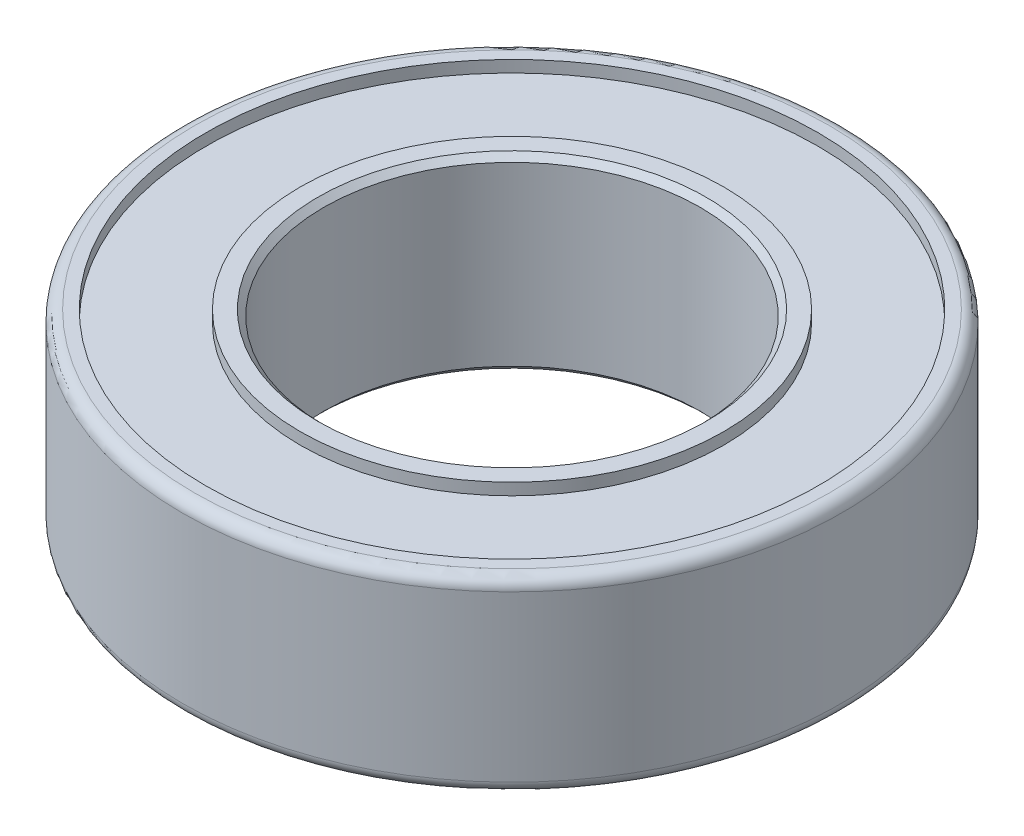
ISO-10303-21;
HEADER;
FILE_DESCRIPTION(('STEP AP214'),'2;1');
FILE_NAME('part.step','',(''),(''),'','','');
FILE_SCHEMA(('AUTOMOTIVE_DESIGN { 1 0 10303 214 1 1 1 1 }'));
ENDSEC;
DATA;
#1=APPLICATION_CONTEXT('core data for automotive mechanical design processes');
#2=APPLICATION_PROTOCOL_DEFINITION('international standard','automotive_design',2000,#1);
#3=PRODUCT_CONTEXT('',#1,'mechanical');
#4=PRODUCT('Part','Part','',(#3));
#5=PRODUCT_RELATED_PRODUCT_CATEGORY('part','',(#4));
#6=PRODUCT_DEFINITION_FORMATION('','',#4);
#7=PRODUCT_DEFINITION_CONTEXT('part definition',#1,'design');
#8=PRODUCT_DEFINITION('design','',#6,#7);
#9=PRODUCT_DEFINITION_SHAPE('','',#8);
#10=(LENGTH_UNIT() NAMED_UNIT(*) SI_UNIT(.MILLI.,.METRE.));
#11=(NAMED_UNIT(*) PLANE_ANGLE_UNIT() SI_UNIT($,.RADIAN.));
#12=(NAMED_UNIT(*) SI_UNIT($,.STERADIAN.) SOLID_ANGLE_UNIT());
#13=UNCERTAINTY_MEASURE_WITH_UNIT(LENGTH_MEASURE(1.E-05),#10,'distance_accuracy_value','');
#14=(GEOMETRIC_REPRESENTATION_CONTEXT(3) GLOBAL_UNCERTAINTY_ASSIGNED_CONTEXT((#13)) GLOBAL_UNIT_ASSIGNED_CONTEXT((#10,
#11,#12)) REPRESENTATION_CONTEXT('',''));
#15=CARTESIAN_POINT('',(0.,0.,0.));
#16=DIRECTION('',(0.,0.,1.));
#17=DIRECTION('',(1.,0.,0.));
#18=AXIS2_PLACEMENT_3D('',#15,#16,#17);
#19=CARTESIAN_POINT('',(0.,-2.,0.));
#20=DIRECTION('',(0.,1.,0.));
#21=DIRECTION('',(0.,0.,1.));
#22=AXIS2_PLACEMENT_3D('',#19,#20,#21);
#23=PLANE('',#22);
#24=CARTESIAN_POINT('',(0.,-2.,0.));
#25=DIRECTION('',(0.,1.,0.));
#26=DIRECTION('',(0.,0.,1.));
#27=AXIS2_PLACEMENT_3D('',#24,#25,#26);
#28=CIRCLE('',#27,4.125);
#29=CARTESIAN_POINT('',(0.,-2.,4.125));
#30=VERTEX_POINT('',#29);
#31=EDGE_CURVE('E10',#30,#30,#28,.T.);
#32=ORIENTED_EDGE('',*,*,#31,.T.);
#33=EDGE_LOOP('',(#32));
#34=FACE_BOUND('',#33,.T.);
#35=CARTESIAN_POINT('',(0.,-2.,0.));
#36=DIRECTION('',(0.,1.,0.));
#37=DIRECTION('',(0.,0.,1.));
#38=AXIS2_PLACEMENT_3D('',#35,#36,#37);
#39=CIRCLE('',#38,4.5);
#40=CARTESIAN_POINT('',(0.,-2.,4.5));
#41=VERTEX_POINT('',#40);
#42=EDGE_CURVE('E97',#41,#41,#39,.T.);
#43=ORIENTED_EDGE('',*,*,#42,.F.);
#44=EDGE_LOOP('',(#43));
#45=FACE_BOUND('',#44,.T.);
#46=ADVANCED_FACE('F45',(#34,#45),#23,.F.);
#47=CARTESIAN_POINT('',(0.,2.,0.));
#48=DIRECTION('',(0.,1.,0.));
#49=DIRECTION('',(0.,0.,1.));
#50=AXIS2_PLACEMENT_3D('',#47,#48,#49);
#51=PLANE('',#50);
#52=CARTESIAN_POINT('',(0.,2.,0.));
#53=DIRECTION('',(0.,1.,0.));
#54=DIRECTION('',(0.,0.,1.));
#55=AXIS2_PLACEMENT_3D('',#52,#53,#54);
#56=CIRCLE('',#55,4.125);
#57=CARTESIAN_POINT('',(0.,2.,4.125));
#58=VERTEX_POINT('',#57);
#59=EDGE_CURVE('E53',#58,#58,#56,.F.);
#60=ORIENTED_EDGE('',*,*,#59,.T.);
#61=EDGE_LOOP('',(#60));
#62=FACE_BOUND('',#61,.T.);
#63=CARTESIAN_POINT('',(0.,2.,0.));
#64=DIRECTION('',(0.,1.,0.));
#65=DIRECTION('',(0.,0.,1.));
#66=AXIS2_PLACEMENT_3D('',#63,#64,#65);
#67=CIRCLE('',#66,4.5);
#68=CARTESIAN_POINT('',(0.,2.,4.5));
#69=VERTEX_POINT('',#68);
#70=EDGE_CURVE('E85',#69,#69,#67,.T.);
#71=ORIENTED_EDGE('',*,*,#70,.T.);
#72=EDGE_LOOP('',(#71));
#73=FACE_BOUND('',#72,.T.);
#74=ADVANCED_FACE('F114',(#62,#73),#51,.T.);
#75=CARTESIAN_POINT('',(0.,2.,0.));
#76=DIRECTION('',(0.,1.,0.));
#77=DIRECTION('',(0.,0.,1.));
#78=AXIS2_PLACEMENT_3D('',#75,#76,#77);
#79=CIRCLE('',#78,6.75);
#80=CARTESIAN_POINT('',(0.,2.,6.75));
#81=VERTEX_POINT('',#80);
#82=EDGE_CURVE('E66',#81,#81,#79,.T.);
#83=ORIENTED_EDGE('',*,*,#82,.T.);
#84=EDGE_LOOP('',(#83));
#85=FACE_BOUND('',#84,.T.);
#86=CARTESIAN_POINT('',(0.,2.,0.));
#87=DIRECTION('',(0.,1.,0.));
#88=DIRECTION('',(0.,0.,1.));
#89=AXIS2_PLACEMENT_3D('',#86,#87,#88);
#90=CIRCLE('',#89,6.5);
#91=CARTESIAN_POINT('',(0.,2.,6.5));
#92=VERTEX_POINT('',#91);
#93=EDGE_CURVE('E79',#92,#92,#90,.T.);
#94=ORIENTED_EDGE('',*,*,#93,.F.);
#95=EDGE_LOOP('',(#94));
#96=FACE_BOUND('',#95,.T.);
#97=ADVANCED_FACE('F121',(#85,#96),#51,.T.);
#98=CARTESIAN_POINT('',(0.,-2.,0.));
#99=DIRECTION('',(0.,1.,0.));
#100=DIRECTION('',(0.,0.,1.));
#101=AXIS2_PLACEMENT_3D('',#98,#99,#100);
#102=CIRCLE('',#101,6.75);
#103=CARTESIAN_POINT('',(0.,-2.,6.75));
#104=VERTEX_POINT('',#103);
#105=EDGE_CURVE('E69',#104,#104,#102,.F.);
#106=ORIENTED_EDGE('',*,*,#105,.T.);
#107=EDGE_LOOP('',(#106));
#108=FACE_BOUND('',#107,.T.);
#109=CARTESIAN_POINT('',(0.,-2.,0.));
#110=DIRECTION('',(0.,1.,0.));
#111=DIRECTION('',(0.,0.,1.));
#112=AXIS2_PLACEMENT_3D('',#109,#110,#111);
#113=CIRCLE('',#112,6.5);
#114=CARTESIAN_POINT('',(0.,-2.,6.5));
#115=VERTEX_POINT('',#114);
#116=EDGE_CURVE('E91',#115,#115,#113,.T.);
#117=ORIENTED_EDGE('',*,*,#116,.T.);
#118=EDGE_LOOP('',(#117));
#119=FACE_BOUND('',#118,.T.);
#120=ADVANCED_FACE('F116',(#108,#119),#23,.F.);
#121=CARTESIAN_POINT('',(0.,2.,0.));
#122=DIRECTION('',(0.,-1.,0.));
#123=DIRECTION('',(0.,0.,-1.));
#124=AXIS2_PLACEMENT_3D('',#121,#122,#123);
#125=CYLINDRICAL_SURFACE('',#124,7.);
#126=CARTESIAN_POINT('',(0.,-1.75,0.));
#127=DIRECTION('',(0.,1.,0.));
#128=DIRECTION('',(0.,0.,1.));
#129=AXIS2_PLACEMENT_3D('',#126,#127,#128);
#130=CIRCLE('',#129,7.);
#131=CARTESIAN_POINT('',(0.,-1.75,7.));
#132=VERTEX_POINT('',#131);
#133=EDGE_CURVE('E72',#132,#132,#130,.T.);
#134=ORIENTED_EDGE('',*,*,#133,.T.);
#135=EDGE_LOOP('',(#134));
#136=FACE_BOUND('',#135,.T.);
#137=CARTESIAN_POINT('',(0.,1.75,0.));
#138=DIRECTION('',(0.,1.,0.));
#139=DIRECTION('',(0.,0.,1.));
#140=AXIS2_PLACEMENT_3D('',#137,#138,#139);
#141=CIRCLE('',#140,7.);
#142=CARTESIAN_POINT('',(0.,1.75,7.));
#143=VERTEX_POINT('',#142);
#144=EDGE_CURVE('E75',#143,#143,#141,.F.);
#145=ORIENTED_EDGE('',*,*,#144,.T.);
#146=EDGE_LOOP('',(#145));
#147=FACE_BOUND('',#146,.T.);
#148=ADVANCED_FACE('F125',(#136,#147),#125,.T.);
#149=CARTESIAN_POINT('',(0.,2.,0.));
#150=DIRECTION('',(0.,-1.,0.));
#151=DIRECTION('',(0.,0.,-1.));
#152=AXIS2_PLACEMENT_3D('',#149,#150,#151);
#153=CYLINDRICAL_SURFACE('',#152,4.);
#154=CARTESIAN_POINT('',(0.,1.875,0.));
#155=DIRECTION('',(0.,1.,0.));
#156=DIRECTION('',(0.,0.,1.));
#157=AXIS2_PLACEMENT_3D('',#154,#155,#156);
#158=CIRCLE('',#157,4.);
#159=CARTESIAN_POINT('',(0.,1.875,4.));
#160=VERTEX_POINT('',#159);
#161=EDGE_CURVE('E57',#160,#160,#158,.T.);
#162=ORIENTED_EDGE('',*,*,#161,.T.);
#163=EDGE_LOOP('',(#162));
#164=FACE_BOUND('',#163,.T.);
#165=CARTESIAN_POINT('',(0.,-1.875,0.));
#166=DIRECTION('',(0.,1.,0.));
#167=DIRECTION('',(0.,0.,1.));
#168=AXIS2_PLACEMENT_3D('',#165,#166,#167);
#169=CIRCLE('',#168,4.);
#170=CARTESIAN_POINT('',(0.,-1.875,4.));
#171=VERTEX_POINT('',#170);
#172=EDGE_CURVE('E61',#171,#171,#169,.F.);
#173=ORIENTED_EDGE('',*,*,#172,.T.);
#174=EDGE_LOOP('',(#173));
#175=FACE_BOUND('',#174,.T.);
#176=ADVANCED_FACE('F131',(#164,#175),#153,.F.);
#177=CARTESIAN_POINT('',(0.,1.75,0.));
#178=DIRECTION('',(0.,1.,0.));
#179=DIRECTION('',(0.,0.,1.));
#180=AXIS2_PLACEMENT_3D('',#177,#178,#179);
#181=CYLINDRICAL_SURFACE('',#180,6.5);
#182=CARTESIAN_POINT('',(0.,1.75,0.));
#183=DIRECTION('',(0.,1.,0.));
#184=DIRECTION('',(0.,0.,1.));
#185=AXIS2_PLACEMENT_3D('',#182,#183,#184);
#186=CIRCLE('',#185,6.5);
#187=CARTESIAN_POINT('',(0.,1.75,6.5));
#188=VERTEX_POINT('',#187);
#189=EDGE_CURVE('E78',#188,#188,#186,.T.);
#190=ORIENTED_EDGE('',*,*,#189,.F.);
#191=EDGE_LOOP('',(#190));
#192=FACE_BOUND('',#191,.T.);
#193=ORIENTED_EDGE('',*,*,#93,.T.);
#194=EDGE_LOOP('',(#193));
#195=FACE_BOUND('',#194,.T.);
#196=ADVANCED_FACE('F154',(#192,#195),#181,.F.);
#197=CARTESIAN_POINT('',(0.,1.75,0.));
#198=DIRECTION('',(0.,1.,0.));
#199=DIRECTION('',(0.,0.,1.));
#200=AXIS2_PLACEMENT_3D('',#197,#198,#199);
#201=PLANE('',#200);
#202=CARTESIAN_POINT('',(0.,1.75,0.));
#203=DIRECTION('',(0.,1.,0.));
#204=DIRECTION('',(0.,0.,1.));
#205=AXIS2_PLACEMENT_3D('',#202,#203,#204);
#206=CIRCLE('',#205,4.5);
#207=CARTESIAN_POINT('',(0.,1.75,4.5));
#208=VERTEX_POINT('',#207);
#209=EDGE_CURVE('E82',#208,#208,#206,.T.);
#210=ORIENTED_EDGE('',*,*,#209,.F.);
#211=EDGE_LOOP('',(#210));
#212=FACE_BOUND('',#211,.T.);
#213=ORIENTED_EDGE('',*,*,#189,.T.);
#214=EDGE_LOOP('',(#213));
#215=FACE_BOUND('',#214,.T.);
#216=ADVANCED_FACE('F150',(#212,#215),#201,.T.);
#217=CARTESIAN_POINT('',(0.,1.75,0.));
#218=DIRECTION('',(0.,1.,0.));
#219=DIRECTION('',(0.,0.,1.));
#220=AXIS2_PLACEMENT_3D('',#217,#218,#219);
#221=CYLINDRICAL_SURFACE('',#220,4.5);
#222=ORIENTED_EDGE('',*,*,#209,.T.);
#223=EDGE_LOOP('',(#222));
#224=FACE_BOUND('',#223,.T.);
#225=ORIENTED_EDGE('',*,*,#70,.F.);
#226=EDGE_LOOP('',(#225));
#227=FACE_BOUND('',#226,.T.);
#228=ADVANCED_FACE('F144',(#224,#227),#221,.T.);
#229=CARTESIAN_POINT('',(0.,-1.75,0.));
#230=DIRECTION('',(0.,-1.,0.));
#231=DIRECTION('',(0.,0.,1.));
#232=AXIS2_PLACEMENT_3D('',#229,#230,#231);
#233=PLANE('',#232);
#234=CARTESIAN_POINT('',(0.,-1.75,0.));
#235=DIRECTION('',(0.,1.,0.));
#236=DIRECTION('',(0.,0.,1.));
#237=AXIS2_PLACEMENT_3D('',#234,#235,#236);
#238=CIRCLE('',#237,6.5);
#239=CARTESIAN_POINT('',(0.,-1.75,6.5));
#240=VERTEX_POINT('',#239);
#241=EDGE_CURVE('E88',#240,#240,#238,.T.);
#242=ORIENTED_EDGE('',*,*,#241,.F.);
#243=EDGE_LOOP('',(#242));
#244=FACE_BOUND('',#243,.T.);
#245=CARTESIAN_POINT('',(0.,-1.75,0.));
#246=DIRECTION('',(0.,1.,0.));
#247=DIRECTION('',(0.,0.,1.));
#248=AXIS2_PLACEMENT_3D('',#245,#246,#247);
#249=CIRCLE('',#248,4.5);
#250=CARTESIAN_POINT('',(0.,-1.75,4.5));
#251=VERTEX_POINT('',#250);
#252=EDGE_CURVE('E94',#251,#251,#249,.T.);
#253=ORIENTED_EDGE('',*,*,#252,.T.);
#254=EDGE_LOOP('',(#253));
#255=FACE_BOUND('',#254,.T.);
#256=ADVANCED_FACE('F103',(#244,#255),#233,.T.);
#257=CARTESIAN_POINT('',(0.,-1.75,0.));
#258=DIRECTION('',(0.,-1.,0.));
#259=DIRECTION('',(0.,0.,-1.));
#260=AXIS2_PLACEMENT_3D('',#257,#258,#259);
#261=CYLINDRICAL_SURFACE('',#260,6.5);
#262=ORIENTED_EDGE('',*,*,#241,.T.);
#263=EDGE_LOOP('',(#262));
#264=FACE_BOUND('',#263,.T.);
#265=ORIENTED_EDGE('',*,*,#116,.F.);
#266=EDGE_LOOP('',(#265));
#267=FACE_BOUND('',#266,.T.);
#268=ADVANCED_FACE('F109',(#264,#267),#261,.F.);
#269=CARTESIAN_POINT('',(0.,-1.75,0.));
#270=DIRECTION('',(0.,-1.,0.));
#271=DIRECTION('',(0.,0.,-1.));
#272=AXIS2_PLACEMENT_3D('',#269,#270,#271);
#273=CYLINDRICAL_SURFACE('',#272,4.5);
#274=ORIENTED_EDGE('',*,*,#252,.F.);
#275=EDGE_LOOP('',(#274));
#276=FACE_BOUND('',#275,.T.);
#277=ORIENTED_EDGE('',*,*,#42,.T.);
#278=EDGE_LOOP('',(#277));
#279=FACE_BOUND('',#278,.T.);
#280=ADVANCED_FACE('F105',(#276,#279),#273,.T.);
#281=CARTESIAN_POINT('',(0.,-1.75,0.));
#282=DIRECTION('',(0.,1.,0.));
#283=DIRECTION('',(0.,0.,1.));
#284=AXIS2_PLACEMENT_3D('',#281,#282,#283);
#285=TOROIDAL_SURFACE('',#284,6.75,0.25);
#286=ORIENTED_EDGE('',*,*,#105,.F.);
#287=EDGE_LOOP('',(#286));
#288=FACE_BOUND('',#287,.T.);
#289=ORIENTED_EDGE('',*,*,#133,.F.);
#290=EDGE_LOOP('',(#289));
#291=FACE_BOUND('',#290,.T.);
#292=ADVANCED_FACE('F108',(#288,#291),#285,.T.);
#293=CARTESIAN_POINT('',(0.,1.75,0.));
#294=DIRECTION('',(0.,1.,0.));
#295=DIRECTION('',(0.,0.,1.));
#296=AXIS2_PLACEMENT_3D('',#293,#294,#295);
#297=TOROIDAL_SURFACE('',#296,6.75,0.25);
#298=ORIENTED_EDGE('',*,*,#144,.F.);
#299=EDGE_LOOP('',(#298));
#300=FACE_BOUND('',#299,.T.);
#301=ORIENTED_EDGE('',*,*,#82,.F.);
#302=EDGE_LOOP('',(#301));
#303=FACE_BOUND('',#302,.T.);
#304=ADVANCED_FACE('F173',(#300,#303),#297,.T.);
#305=CARTESIAN_POINT('',(0.,1.875,0.));
#306=DIRECTION('',(0.,1.,0.));
#307=DIRECTION('',(0.,0.,1.));
#308=AXIS2_PLACEMENT_3D('',#305,#306,#307);
#309=CONICAL_SURFACE('',#308,4.,0.785398163397448);
#310=ORIENTED_EDGE('',*,*,#59,.F.);
#311=EDGE_LOOP('',(#310));
#312=FACE_BOUND('',#311,.T.);
#313=ORIENTED_EDGE('',*,*,#161,.F.);
#314=EDGE_LOOP('',(#313));
#315=FACE_BOUND('',#314,.T.);
#316=ADVANCED_FACE('F170',(#312,#315),#309,.F.);
#317=CARTESIAN_POINT('',(0.,-2.,0.));
#318=DIRECTION('',(0.,-1.,0.));
#319=DIRECTION('',(0.,0.,-1.));
#320=AXIS2_PLACEMENT_3D('',#317,#318,#319);
#321=CONICAL_SURFACE('',#320,4.125,0.785398163397435);
#322=ORIENTED_EDGE('',*,*,#172,.F.);
#323=EDGE_LOOP('',(#322));
#324=FACE_BOUND('',#323,.T.);
#325=ORIENTED_EDGE('',*,*,#31,.F.);
#326=EDGE_LOOP('',(#325));
#327=FACE_BOUND('',#326,.T.);
#328=ADVANCED_FACE('F48',(#324,#327),#321,.F.);
#329=CLOSED_SHELL('',(#46,#74,#97,#120,#148,#176,#196,#216,#228,#256,#268,#280,#292,#304,#316,#328));
#330=MANIFOLD_SOLID_BREP('B2',#329);
#331=ADVANCED_BREP_SHAPE_REPRESENTATION('',(#18,#330),#14);
#332=SHAPE_DEFINITION_REPRESENTATION(#9,#331);
ENDSEC;
END-ISO-10303-21;
